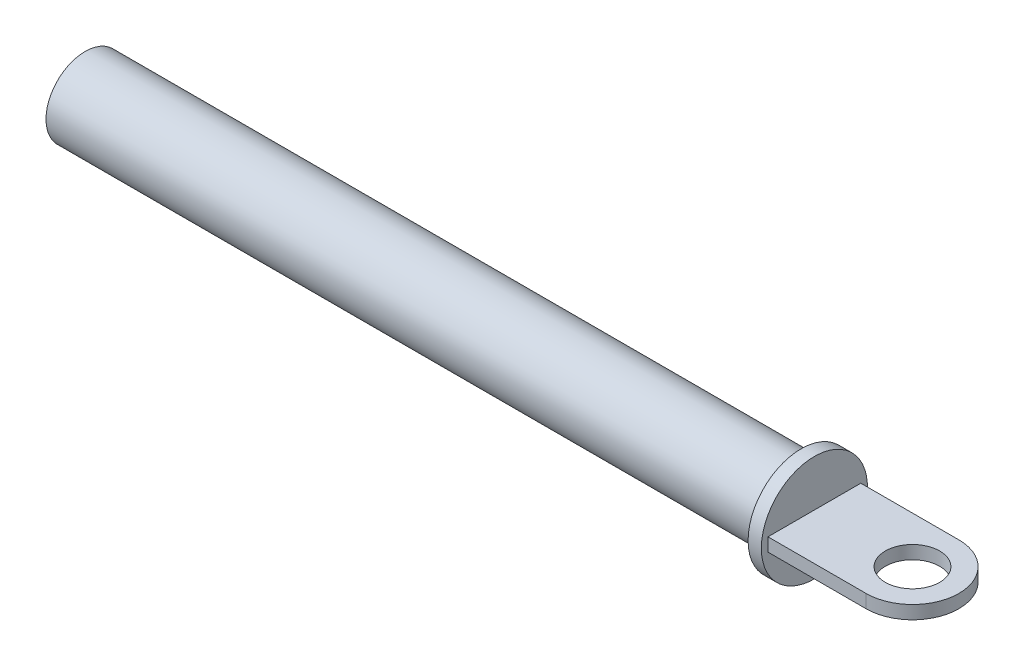
ISO-10303-21;
HEADER;
FILE_DESCRIPTION(('STEP AP214'),'2;1');
FILE_NAME('part.step','',(''),(''),'','','');
FILE_SCHEMA(('AUTOMOTIVE_DESIGN { 1 0 10303 214 1 1 1 1 }'));
ENDSEC;
DATA;
#1=APPLICATION_CONTEXT('core data for automotive mechanical design processes');
#2=APPLICATION_PROTOCOL_DEFINITION('international standard','automotive_design',2000,#1);
#3=PRODUCT_CONTEXT('',#1,'mechanical');
#4=PRODUCT('Part','Part','',(#3));
#5=PRODUCT_RELATED_PRODUCT_CATEGORY('part','',(#4));
#6=PRODUCT_DEFINITION_FORMATION('','',#4);
#7=PRODUCT_DEFINITION_CONTEXT('part definition',#1,'design');
#8=PRODUCT_DEFINITION('design','',#6,#7);
#9=PRODUCT_DEFINITION_SHAPE('','',#8);
#10=(LENGTH_UNIT() NAMED_UNIT(*) SI_UNIT(.MILLI.,.METRE.));
#11=(NAMED_UNIT(*) PLANE_ANGLE_UNIT() SI_UNIT($,.RADIAN.));
#12=(NAMED_UNIT(*) SI_UNIT($,.STERADIAN.) SOLID_ANGLE_UNIT());
#13=UNCERTAINTY_MEASURE_WITH_UNIT(LENGTH_MEASURE(1.E-05),#10,'distance_accuracy_value','');
#14=(GEOMETRIC_REPRESENTATION_CONTEXT(3) GLOBAL_UNCERTAINTY_ASSIGNED_CONTEXT((#13)) GLOBAL_UNIT_ASSIGNED_CONTEXT((#10,
#11,#12)) REPRESENTATION_CONTEXT('',''));
#15=CARTESIAN_POINT('',(0.,0.,0.));
#16=DIRECTION('',(0.,0.,1.));
#17=DIRECTION('',(1.,0.,0.));
#18=AXIS2_PLACEMENT_3D('',#15,#16,#17);
#19=CARTESIAN_POINT('',(33.,0.,0.));
#20=DIRECTION('',(-1.,0.,0.));
#21=DIRECTION('',(0.,0.,1.));
#22=AXIS2_PLACEMENT_3D('',#19,#20,#21);
#23=CYLINDRICAL_SURFACE('',#22,4.);
#24=CARTESIAN_POINT('',(33.,0.,0.));
#25=DIRECTION('',(-1.,0.,0.));
#26=DIRECTION('',(0.,0.,1.));
#27=AXIS2_PLACEMENT_3D('',#24,#25,#26);
#28=CIRCLE('',#27,4.);
#29=CARTESIAN_POINT('',(33.,0.,4.));
#30=VERTEX_POINT('',#29);
#31=EDGE_CURVE('E47',#30,#30,#28,.T.);
#32=ORIENTED_EDGE('',*,*,#31,.T.);
#33=EDGE_LOOP('',(#32));
#34=FACE_BOUND('',#33,.T.);
#35=CARTESIAN_POINT('',(32.,0.,0.));
#36=DIRECTION('',(-1.,0.,0.));
#37=DIRECTION('',(0.,0.,1.));
#38=AXIS2_PLACEMENT_3D('',#35,#36,#37);
#39=CIRCLE('',#38,4.);
#40=CARTESIAN_POINT('',(32.,0.,4.));
#41=VERTEX_POINT('',#40);
#42=EDGE_CURVE('E120',#41,#41,#39,.T.);
#43=ORIENTED_EDGE('',*,*,#42,.F.);
#44=EDGE_LOOP('',(#43));
#45=FACE_BOUND('',#44,.T.);
#46=ADVANCED_FACE('F39',(#34,#45),#23,.T.);
#47=CARTESIAN_POINT('',(33.,4.,0.));
#48=DIRECTION('',(1.,0.,0.));
#49=DIRECTION('',(0.,0.,-1.));
#50=AXIS2_PLACEMENT_3D('',#47,#48,#49);
#51=PLANE('',#50);
#52=DIRECTION('',(0.,0.,1.));
#53=VECTOR('',#52,1.);
#54=CARTESIAN_POINT('',(33.,0.5,-3.5));
#55=LINE('',#54,#53);
#56=CARTESIAN_POINT('',(33.,0.5,-3.5));
#57=VERTEX_POINT('',#56);
#58=CARTESIAN_POINT('',(33.,0.5,3.5));
#59=VERTEX_POINT('',#58);
#60=EDGE_CURVE('E55',#57,#59,#55,.T.);
#61=ORIENTED_EDGE('',*,*,#60,.F.);
#62=DIRECTION('',(0.,1.,0.));
#63=VECTOR('',#62,1.);
#64=CARTESIAN_POINT('',(33.,-0.5,-3.5));
#65=LINE('',#64,#63);
#66=CARTESIAN_POINT('',(33.,-0.5,-3.5));
#67=VERTEX_POINT('',#66);
#68=EDGE_CURVE('E98',#67,#57,#65,.T.);
#69=ORIENTED_EDGE('',*,*,#68,.F.);
#70=DIRECTION('',(0.,0.,1.));
#71=VECTOR('',#70,1.);
#72=CARTESIAN_POINT('',(33.,-0.5,-3.5));
#73=LINE('',#72,#71);
#74=CARTESIAN_POINT('',(33.,-0.5,3.5));
#75=VERTEX_POINT('',#74);
#76=EDGE_CURVE('E86',#67,#75,#73,.T.);
#77=ORIENTED_EDGE('',*,*,#76,.T.);
#78=DIRECTION('',(0.,1.,0.));
#79=VECTOR('',#78,1.);
#80=CARTESIAN_POINT('',(33.,-0.5,3.5));
#81=LINE('',#80,#79);
#82=EDGE_CURVE('E91',#75,#59,#81,.T.);
#83=ORIENTED_EDGE('',*,*,#82,.T.);
#84=EDGE_LOOP('',(#61,#69,#77,#83));
#85=FACE_BOUND('',#84,.T.);
#86=ORIENTED_EDGE('',*,*,#31,.F.);
#87=EDGE_LOOP('',(#86));
#88=FACE_BOUND('',#87,.T.);
#89=ADVANCED_FACE('F104',(#85,#88),#51,.T.);
#90=CARTESIAN_POINT('',(32.,0.,0.));
#91=DIRECTION('',(-1.,0.,0.));
#92=DIRECTION('',(0.,0.,1.));
#93=AXIS2_PLACEMENT_3D('',#90,#91,#92);
#94=PLANE('',#93);
#95=CARTESIAN_POINT('',(32.,0.,0.));
#96=DIRECTION('',(-1.,0.,0.));
#97=DIRECTION('',(0.,0.,1.));
#98=AXIS2_PLACEMENT_3D('',#95,#96,#97);
#99=CIRCLE('',#98,2.95);
#100=CARTESIAN_POINT('',(32.,0.,2.95));
#101=VERTEX_POINT('',#100);
#102=EDGE_CURVE('E11',#101,#101,#99,.T.);
#103=ORIENTED_EDGE('',*,*,#102,.F.);
#104=EDGE_LOOP('',(#103));
#105=FACE_BOUND('',#104,.T.);
#106=ORIENTED_EDGE('',*,*,#42,.T.);
#107=EDGE_LOOP('',(#106));
#108=FACE_BOUND('',#107,.T.);
#109=ADVANCED_FACE('F129',(#105,#108),#94,.T.);
#110=CARTESIAN_POINT('',(40.39840589397,-0.5,-3.5));
#111=DIRECTION('',(0.,0.,-1.));
#112=DIRECTION('',(-1.,0.,0.));
#113=AXIS2_PLACEMENT_3D('',#110,#111,#112);
#114=PLANE('',#113);
#115=DIRECTION('',(-1.,0.,0.));
#116=VECTOR('',#115,1.);
#117=CARTESIAN_POINT('',(40.39840589397,0.5,-3.5));
#118=LINE('',#117,#116);
#119=CARTESIAN_POINT('',(40.39840589397,0.5,-3.5));
#120=VERTEX_POINT('',#119);
#121=EDGE_CURVE('E112',#120,#57,#118,.T.);
#122=ORIENTED_EDGE('',*,*,#121,.F.);
#123=DIRECTION('',(0.,1.,0.));
#124=VECTOR('',#123,1.);
#125=CARTESIAN_POINT('',(40.39840589397,-0.5,-3.5));
#126=LINE('',#125,#124);
#127=CARTESIAN_POINT('',(40.39840589397,-0.5,-3.5));
#128=VERTEX_POINT('',#127);
#129=EDGE_CURVE('E64',#128,#120,#126,.T.);
#130=ORIENTED_EDGE('',*,*,#129,.F.);
#131=DIRECTION('',(-1.,0.,0.));
#132=VECTOR('',#131,1.);
#133=CARTESIAN_POINT('',(40.39840589397,-0.5,-3.5));
#134=LINE('',#133,#132);
#135=EDGE_CURVE('E106',#128,#67,#134,.T.);
#136=ORIENTED_EDGE('',*,*,#135,.T.);
#137=ORIENTED_EDGE('',*,*,#68,.T.);
#138=EDGE_LOOP('',(#122,#130,#136,#137));
#139=FACE_BOUND('',#138,.T.);
#140=ADVANCED_FACE('F135',(#139),#114,.T.);
#141=CARTESIAN_POINT('',(40.39840589397,-0.5,0.));
#142=DIRECTION('',(0.,1.,0.));
#143=DIRECTION('',(0.,0.,1.));
#144=AXIS2_PLACEMENT_3D('',#141,#142,#143);
#145=CYLINDRICAL_SURFACE('',#144,3.5);
#146=CARTESIAN_POINT('',(40.39840589397,0.5,0.));
#147=DIRECTION('',(0.,1.,0.));
#148=DIRECTION('',(0.,0.,1.));
#149=AXIS2_PLACEMENT_3D('',#146,#147,#148);
#150=CIRCLE('',#149,3.5);
#151=CARTESIAN_POINT('',(40.39840589397,0.5,3.5));
#152=VERTEX_POINT('',#151);
#153=EDGE_CURVE('E108',#152,#120,#150,.T.);
#154=ORIENTED_EDGE('',*,*,#153,.F.);
#155=DIRECTION('',(0.,1.,0.));
#156=VECTOR('',#155,1.);
#157=CARTESIAN_POINT('',(40.39840589397,-0.5,3.5));
#158=LINE('',#157,#156);
#159=CARTESIAN_POINT('',(40.39840589397,-0.5,3.5));
#160=VERTEX_POINT('',#159);
#161=EDGE_CURVE('E97',#160,#152,#158,.T.);
#162=ORIENTED_EDGE('',*,*,#161,.F.);
#163=CARTESIAN_POINT('',(40.39840589397,-0.5,0.));
#164=DIRECTION('',(0.,1.,0.));
#165=DIRECTION('',(0.,0.,1.));
#166=AXIS2_PLACEMENT_3D('',#163,#164,#165);
#167=CIRCLE('',#166,3.5);
#168=EDGE_CURVE('E101',#160,#128,#167,.T.);
#169=ORIENTED_EDGE('',*,*,#168,.T.);
#170=ORIENTED_EDGE('',*,*,#129,.T.);
#171=EDGE_LOOP('',(#154,#162,#169,#170));
#172=FACE_BOUND('',#171,.T.);
#173=ADVANCED_FACE('F140',(#172),#145,.T.);
#174=CARTESIAN_POINT('',(33.,-0.5,3.5));
#175=DIRECTION('',(0.,0.,1.));
#176=DIRECTION('',(1.,0.,0.));
#177=AXIS2_PLACEMENT_3D('',#174,#175,#176);
#178=PLANE('',#177);
#179=DIRECTION('',(1.,0.,0.));
#180=VECTOR('',#179,1.);
#181=CARTESIAN_POINT('',(33.,0.5,3.5));
#182=LINE('',#181,#180);
#183=EDGE_CURVE('E95',#59,#152,#182,.T.);
#184=ORIENTED_EDGE('',*,*,#183,.F.);
#185=ORIENTED_EDGE('',*,*,#82,.F.);
#186=DIRECTION('',(1.,0.,0.));
#187=VECTOR('',#186,1.);
#188=CARTESIAN_POINT('',(33.,-0.5,3.5));
#189=LINE('',#188,#187);
#190=EDGE_CURVE('E93',#75,#160,#189,.T.);
#191=ORIENTED_EDGE('',*,*,#190,.T.);
#192=ORIENTED_EDGE('',*,*,#161,.T.);
#193=EDGE_LOOP('',(#184,#185,#191,#192));
#194=FACE_BOUND('',#193,.T.);
#195=ADVANCED_FACE('F92',(#194),#178,.T.);
#196=CARTESIAN_POINT('',(40.39840589397,-0.5,0.));
#197=DIRECTION('',(0.,1.,0.));
#198=DIRECTION('',(0.,0.,1.));
#199=AXIS2_PLACEMENT_3D('',#196,#197,#198);
#200=PLANE('',#199);
#201=CARTESIAN_POINT('',(40.39840589397,-0.5,0.));
#202=DIRECTION('',(0.,-1.,0.));
#203=DIRECTION('',(0.,0.,-1.));
#204=AXIS2_PLACEMENT_3D('',#201,#202,#203);
#205=CIRCLE('',#204,2.05);
#206=CARTESIAN_POINT('',(40.39840589397,-0.5,-2.05));
#207=VERTEX_POINT('',#206);
#208=EDGE_CURVE('E170',#207,#207,#205,.T.);
#209=ORIENTED_EDGE('',*,*,#208,.F.);
#210=EDGE_LOOP('',(#209));
#211=FACE_BOUND('',#210,.T.);
#212=ORIENTED_EDGE('',*,*,#135,.F.);
#213=ORIENTED_EDGE('',*,*,#168,.F.);
#214=ORIENTED_EDGE('',*,*,#190,.F.);
#215=ORIENTED_EDGE('',*,*,#76,.F.);
#216=EDGE_LOOP('',(#212,#213,#214,#215));
#217=FACE_BOUND('',#216,.T.);
#218=ADVANCED_FACE('F100',(#211,#217),#200,.F.);
#219=CARTESIAN_POINT('',(40.39840589397,0.5,0.));
#220=DIRECTION('',(0.,1.,0.));
#221=DIRECTION('',(0.,0.,1.));
#222=AXIS2_PLACEMENT_3D('',#219,#220,#221);
#223=PLANE('',#222);
#224=CARTESIAN_POINT('',(40.39840589397,0.5,0.));
#225=DIRECTION('',(0.,1.,0.));
#226=DIRECTION('',(0.,0.,1.));
#227=AXIS2_PLACEMENT_3D('',#224,#225,#226);
#228=CIRCLE('',#227,2.05);
#229=CARTESIAN_POINT('',(40.39840589397,0.5,2.04999999999999));
#230=VERTEX_POINT('',#229);
#231=EDGE_CURVE('E42',#230,#230,#228,.T.);
#232=ORIENTED_EDGE('',*,*,#231,.F.);
#233=EDGE_LOOP('',(#232));
#234=FACE_BOUND('',#233,.T.);
#235=ORIENTED_EDGE('',*,*,#121,.T.);
#236=ORIENTED_EDGE('',*,*,#60,.T.);
#237=ORIENTED_EDGE('',*,*,#183,.T.);
#238=ORIENTED_EDGE('',*,*,#153,.T.);
#239=EDGE_LOOP('',(#235,#236,#237,#238));
#240=FACE_BOUND('',#239,.T.);
#241=ADVANCED_FACE('F145',(#234,#240),#223,.T.);
#242=CARTESIAN_POINT('',(-22.,0.,0.));
#243=DIRECTION('',(1.,0.,0.));
#244=DIRECTION('',(0.,0.,-1.));
#245=AXIS2_PLACEMENT_3D('',#242,#243,#244);
#246=CYLINDRICAL_SURFACE('',#245,2.95);
#247=CARTESIAN_POINT('',(-22.,0.,0.));
#248=DIRECTION('',(-1.,0.,0.));
#249=DIRECTION('',(0.,0.,1.));
#250=AXIS2_PLACEMENT_3D('',#247,#248,#249);
#251=CIRCLE('',#250,2.95);
#252=CARTESIAN_POINT('',(-22.,0.,2.95));
#253=VERTEX_POINT('',#252);
#254=EDGE_CURVE('E114',#253,#253,#251,.T.);
#255=ORIENTED_EDGE('',*,*,#254,.F.);
#256=EDGE_LOOP('',(#255));
#257=FACE_BOUND('',#256,.T.);
#258=ORIENTED_EDGE('',*,*,#102,.T.);
#259=EDGE_LOOP('',(#258));
#260=FACE_BOUND('',#259,.T.);
#261=ADVANCED_FACE('F148',(#257,#260),#246,.T.);
#262=CARTESIAN_POINT('',(-22.,0.,0.));
#263=DIRECTION('',(-1.,0.,0.));
#264=DIRECTION('',(0.,0.,1.));
#265=AXIS2_PLACEMENT_3D('',#262,#263,#264);
#266=PLANE('',#265);
#267=ORIENTED_EDGE('',*,*,#254,.T.);
#268=EDGE_LOOP('',(#267));
#269=FACE_BOUND('',#268,.T.);
#270=ADVANCED_FACE('F155',(#269),#266,.T.);
#271=CARTESIAN_POINT('',(40.39840589397,-0.5,0.));
#272=DIRECTION('',(0.,-1.,0.));
#273=DIRECTION('',(0.,0.,-1.));
#274=AXIS2_PLACEMENT_3D('',#271,#272,#273);
#275=CYLINDRICAL_SURFACE('',#274,2.05);
#276=ORIENTED_EDGE('',*,*,#231,.T.);
#277=EDGE_LOOP('',(#276));
#278=FACE_BOUND('',#277,.T.);
#279=ORIENTED_EDGE('',*,*,#208,.T.);
#280=EDGE_LOOP('',(#279));
#281=FACE_BOUND('',#280,.T.);
#282=ADVANCED_FACE('F159',(#278,#281),#275,.F.);
#283=CLOSED_SHELL('',(#46,#89,#109,#140,#173,#195,#218,#241,#261,#270,#282));
#284=MANIFOLD_SOLID_BREP('B2',#283);
#285=ADVANCED_BREP_SHAPE_REPRESENTATION('',(#18,#284),#14);
#286=SHAPE_DEFINITION_REPRESENTATION(#9,#285);
ENDSEC;
END-ISO-10303-21;
